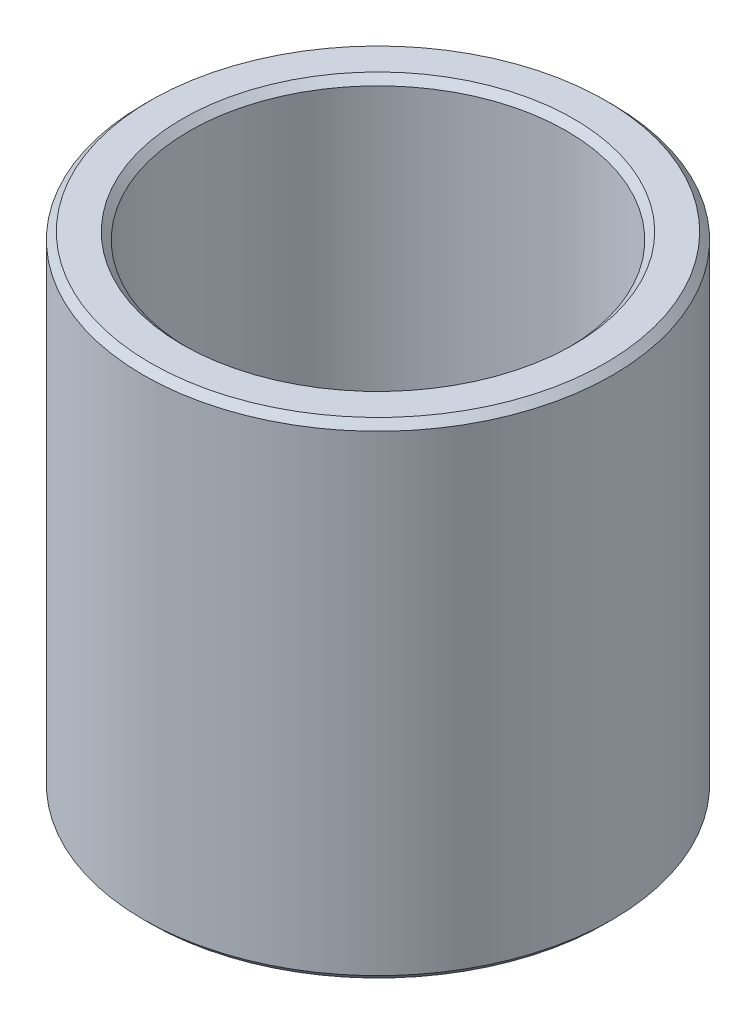
ISO-10303-21;
HEADER;
FILE_DESCRIPTION(('STEP AP214'),'2;1');
FILE_NAME('part.step','',(''),(''),'','','');
FILE_SCHEMA(('AUTOMOTIVE_DESIGN { 1 0 10303 214 1 1 1 1 }'));
ENDSEC;
DATA;
#1=APPLICATION_CONTEXT('core data for automotive mechanical design processes');
#2=APPLICATION_PROTOCOL_DEFINITION('international standard','automotive_design',2000,#1);
#3=PRODUCT_CONTEXT('',#1,'mechanical');
#4=PRODUCT('Part','Part','',(#3));
#5=PRODUCT_RELATED_PRODUCT_CATEGORY('part','',(#4));
#6=PRODUCT_DEFINITION_FORMATION('','',#4);
#7=PRODUCT_DEFINITION_CONTEXT('part definition',#1,'design');
#8=PRODUCT_DEFINITION('design','',#6,#7);
#9=PRODUCT_DEFINITION_SHAPE('','',#8);
#10=(LENGTH_UNIT() NAMED_UNIT(*) SI_UNIT(.MILLI.,.METRE.));
#11=(NAMED_UNIT(*) PLANE_ANGLE_UNIT() SI_UNIT($,.RADIAN.));
#12=(NAMED_UNIT(*) SI_UNIT($,.STERADIAN.) SOLID_ANGLE_UNIT());
#13=UNCERTAINTY_MEASURE_WITH_UNIT(LENGTH_MEASURE(1.E-05),#10,'distance_accuracy_value','');
#14=(GEOMETRIC_REPRESENTATION_CONTEXT(3) GLOBAL_UNCERTAINTY_ASSIGNED_CONTEXT((#13)) GLOBAL_UNIT_ASSIGNED_CONTEXT((#10,
#11,#12)) REPRESENTATION_CONTEXT('',''));
#15=CARTESIAN_POINT('',(0.,0.,0.));
#16=DIRECTION('',(0.,0.,1.));
#17=DIRECTION('',(1.,0.,0.));
#18=AXIS2_PLACEMENT_3D('',#15,#16,#17);
#19=CARTESIAN_POINT('',(0.,87.9899682211614,0.));
#20=DIRECTION('',(0.,-1.,0.));
#21=DIRECTION('',(0.,0.,-1.));
#22=AXIS2_PLACEMENT_3D('',#19,#20,#21);
#23=CYLINDRICAL_SURFACE('',#22,42.5);
#24=CARTESIAN_POINT('',(0.,1.27459549560807,0.));
#25=DIRECTION('',(0.,1.,0.));
#26=DIRECTION('',(0.,0.,1.));
#27=AXIS2_PLACEMENT_3D('',#24,#25,#26);
#28=CIRCLE('',#27,42.5);
#29=CARTESIAN_POINT('',(0.,1.27459549560807,42.5));
#30=VERTEX_POINT('',#29);
#31=EDGE_CURVE('E10',#30,#30,#28,.T.);
#32=ORIENTED_EDGE('',*,*,#31,.T.);
#33=EDGE_LOOP('',(#32));
#34=FACE_BOUND('',#33,.T.);
#35=CARTESIAN_POINT('',(0.,86.7153727255533,0.));
#36=DIRECTION('',(0.,1.,0.));
#37=DIRECTION('',(0.,0.,1.));
#38=AXIS2_PLACEMENT_3D('',#35,#36,#37);
#39=CIRCLE('',#38,42.5);
#40=CARTESIAN_POINT('',(0.,86.7153727255533,42.5));
#41=VERTEX_POINT('',#40);
#42=EDGE_CURVE('E50',#41,#41,#39,.F.);
#43=ORIENTED_EDGE('',*,*,#42,.T.);
#44=EDGE_LOOP('',(#43));
#45=FACE_BOUND('',#44,.T.);
#46=ADVANCED_FACE('F39',(#34,#45),#23,.T.);
#47=CARTESIAN_POINT('',(0.,87.9899682211614,0.));
#48=DIRECTION('',(0.,1.,0.));
#49=DIRECTION('',(0.,0.,1.));
#50=AXIS2_PLACEMENT_3D('',#47,#48,#49);
#51=PLANE('',#50);
#52=CARTESIAN_POINT('',(0.,87.9899682211614,0.));
#53=DIRECTION('',(0.,1.,0.));
#54=DIRECTION('',(0.,0.,1.));
#55=AXIS2_PLACEMENT_3D('',#52,#53,#54);
#56=CIRCLE('',#55,35.4628657017837);
#57=CARTESIAN_POINT('',(0.,87.9899682211614,35.4628657017837));
#58=VERTEX_POINT('',#57);
#59=EDGE_CURVE('E58',#58,#58,#56,.F.);
#60=ORIENTED_EDGE('',*,*,#59,.T.);
#61=EDGE_LOOP('',(#60));
#62=FACE_BOUND('',#61,.T.);
#63=CARTESIAN_POINT('',(0.,87.9899682211614,0.));
#64=DIRECTION('',(0.,1.,0.));
#65=DIRECTION('',(0.,0.,1.));
#66=AXIS2_PLACEMENT_3D('',#63,#64,#65);
#67=CIRCLE('',#66,41.2254045043919);
#68=CARTESIAN_POINT('',(0.,87.9899682211614,41.2254045043919));
#69=VERTEX_POINT('',#68);
#70=EDGE_CURVE('E61',#69,#69,#67,.T.);
#71=ORIENTED_EDGE('',*,*,#70,.T.);
#72=EDGE_LOOP('',(#71));
#73=FACE_BOUND('',#72,.T.);
#74=ADVANCED_FACE('F88',(#62,#73),#51,.T.);
#75=CARTESIAN_POINT('',(0.,0.,0.));
#76=DIRECTION('',(0.,1.,0.));
#77=DIRECTION('',(0.,0.,1.));
#78=AXIS2_PLACEMENT_3D('',#75,#76,#77);
#79=PLANE('',#78);
#80=CARTESIAN_POINT('',(0.,0.,0.));
#81=DIRECTION('',(0.,1.,0.));
#82=DIRECTION('',(0.,0.,1.));
#83=AXIS2_PLACEMENT_3D('',#80,#81,#82);
#84=CIRCLE('',#83,35.4628657017837);
#85=CARTESIAN_POINT('',(0.,0.,35.4628657017837));
#86=VERTEX_POINT('',#85);
#87=EDGE_CURVE('E51',#86,#86,#84,.T.);
#88=ORIENTED_EDGE('',*,*,#87,.T.);
#89=EDGE_LOOP('',(#88));
#90=FACE_BOUND('',#89,.T.);
#91=CARTESIAN_POINT('',(0.,0.,0.));
#92=DIRECTION('',(0.,1.,0.));
#93=DIRECTION('',(0.,0.,1.));
#94=AXIS2_PLACEMENT_3D('',#91,#92,#93);
#95=CIRCLE('',#94,41.2254045043919);
#96=CARTESIAN_POINT('',(0.,0.,41.2254045043919));
#97=VERTEX_POINT('',#96);
#98=EDGE_CURVE('E54',#97,#97,#95,.F.);
#99=ORIENTED_EDGE('',*,*,#98,.T.);
#100=EDGE_LOOP('',(#99));
#101=FACE_BOUND('',#100,.T.);
#102=ADVANCED_FACE('F83',(#90,#101),#79,.F.);
#103=CARTESIAN_POINT('',(0.,87.9899682211614,0.));
#104=DIRECTION('',(0.,-1.,0.));
#105=DIRECTION('',(0.,0.,-1.));
#106=AXIS2_PLACEMENT_3D('',#103,#104,#105);
#107=CYLINDRICAL_SURFACE('',#106,34.1882702061756);
#108=CARTESIAN_POINT('',(0.,86.7153727255533,0.));
#109=DIRECTION('',(0.,1.,0.));
#110=DIRECTION('',(0.,0.,1.));
#111=AXIS2_PLACEMENT_3D('',#108,#109,#110);
#112=CIRCLE('',#111,34.1882702061756);
#113=CARTESIAN_POINT('',(0.,86.7153727255533,34.1882702061756));
#114=VERTEX_POINT('',#113);
#115=EDGE_CURVE('E67',#114,#114,#112,.T.);
#116=ORIENTED_EDGE('',*,*,#115,.T.);
#117=EDGE_LOOP('',(#116));
#118=FACE_BOUND('',#117,.T.);
#119=CARTESIAN_POINT('',(0.,1.2745954956081,0.));
#120=DIRECTION('',(0.,1.,0.));
#121=DIRECTION('',(0.,0.,1.));
#122=AXIS2_PLACEMENT_3D('',#119,#120,#121);
#123=CIRCLE('',#122,34.1882702061756);
#124=CARTESIAN_POINT('',(0.,1.2745954956081,34.1882702061756));
#125=VERTEX_POINT('',#124);
#126=EDGE_CURVE('E69',#125,#125,#123,.F.);
#127=ORIENTED_EDGE('',*,*,#126,.T.);
#128=EDGE_LOOP('',(#127));
#129=FACE_BOUND('',#128,.T.);
#130=ADVANCED_FACE('F71',(#118,#129),#107,.F.);
#131=CARTESIAN_POINT('',(0.,86.7153727255533,0.));
#132=DIRECTION('',(0.,1.,0.));
#133=DIRECTION('',(0.,0.,1.));
#134=AXIS2_PLACEMENT_3D('',#131,#132,#133);
#135=CONICAL_SURFACE('',#134,34.1882702061756,0.785398163397446);
#136=ORIENTED_EDGE('',*,*,#59,.F.);
#137=EDGE_LOOP('',(#136));
#138=FACE_BOUND('',#137,.T.);
#139=ORIENTED_EDGE('',*,*,#115,.F.);
#140=EDGE_LOOP('',(#139));
#141=FACE_BOUND('',#140,.T.);
#142=ADVANCED_FACE('F77',(#138,#141),#135,.F.);
#143=CARTESIAN_POINT('',(0.,0.,0.));
#144=DIRECTION('',(0.,-1.,0.));
#145=DIRECTION('',(0.,0.,-1.));
#146=AXIS2_PLACEMENT_3D('',#143,#144,#145);
#147=CONICAL_SURFACE('',#146,35.4628657017837,0.78539816339744);
#148=ORIENTED_EDGE('',*,*,#126,.F.);
#149=EDGE_LOOP('',(#148));
#150=FACE_BOUND('',#149,.T.);
#151=ORIENTED_EDGE('',*,*,#87,.F.);
#152=EDGE_LOOP('',(#151));
#153=FACE_BOUND('',#152,.T.);
#154=ADVANCED_FACE('F73',(#150,#153),#147,.F.);
#155=CARTESIAN_POINT('',(0.,1.27459549560807,0.));
#156=DIRECTION('',(0.,1.,0.));
#157=DIRECTION('',(0.,0.,1.));
#158=AXIS2_PLACEMENT_3D('',#155,#156,#157);
#159=CONICAL_SURFACE('',#158,42.5,0.785398163397454);
#160=ORIENTED_EDGE('',*,*,#98,.F.);
#161=EDGE_LOOP('',(#160));
#162=FACE_BOUND('',#161,.T.);
#163=ORIENTED_EDGE('',*,*,#31,.F.);
#164=EDGE_LOOP('',(#163));
#165=FACE_BOUND('',#164,.T.);
#166=ADVANCED_FACE('F76',(#162,#165),#159,.T.);
#167=CARTESIAN_POINT('',(0.,87.9899682211614,0.));
#168=DIRECTION('',(0.,-1.,0.));
#169=DIRECTION('',(0.,0.,-1.));
#170=AXIS2_PLACEMENT_3D('',#167,#168,#169);
#171=CONICAL_SURFACE('',#170,41.2254045043919,0.785398163397432);
#172=ORIENTED_EDGE('',*,*,#42,.F.);
#173=EDGE_LOOP('',(#172));
#174=FACE_BOUND('',#173,.T.);
#175=ORIENTED_EDGE('',*,*,#70,.F.);
#176=EDGE_LOOP('',(#175));
#177=FACE_BOUND('',#176,.T.);
#178=ADVANCED_FACE('F45',(#174,#177),#171,.T.);
#179=CLOSED_SHELL('',(#46,#74,#102,#130,#142,#154,#166,#178));
#180=MANIFOLD_SOLID_BREP('B2',#179);
#181=ADVANCED_BREP_SHAPE_REPRESENTATION('',(#18,#180),#14);
#182=SHAPE_DEFINITION_REPRESENTATION(#9,#181);
ENDSEC;
END-ISO-10303-21;
